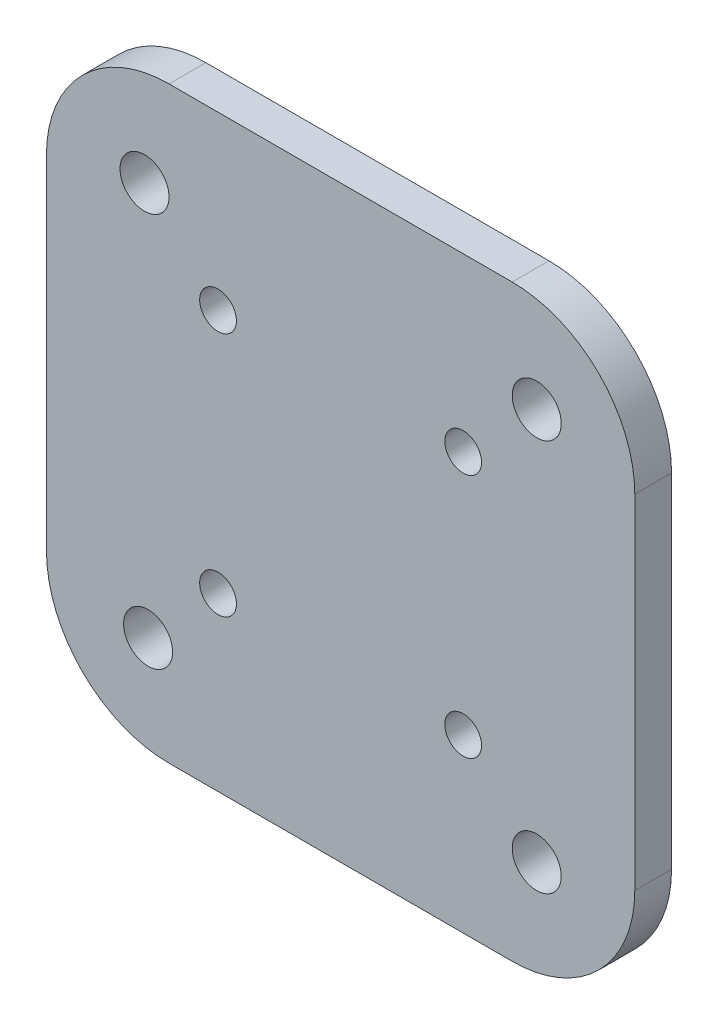
ISO-10303-21;
HEADER;
FILE_DESCRIPTION(('STEP AP214'),'2;1');
FILE_NAME('part.step','',(''),(''),'','','');
FILE_SCHEMA(('AUTOMOTIVE_DESIGN { 1 0 10303 214 1 1 1 1 }'));
ENDSEC;
DATA;
#1=APPLICATION_CONTEXT('core data for automotive mechanical design processes');
#2=APPLICATION_PROTOCOL_DEFINITION('international standard','automotive_design',2000,#1);
#3=PRODUCT_CONTEXT('',#1,'mechanical');
#4=PRODUCT('Part','Part','',(#3));
#5=PRODUCT_RELATED_PRODUCT_CATEGORY('part','',(#4));
#6=PRODUCT_DEFINITION_FORMATION('','',#4);
#7=PRODUCT_DEFINITION_CONTEXT('part definition',#1,'design');
#8=PRODUCT_DEFINITION('design','',#6,#7);
#9=PRODUCT_DEFINITION_SHAPE('','',#8);
#10=(LENGTH_UNIT() NAMED_UNIT(*) SI_UNIT(.MILLI.,.METRE.));
#11=(NAMED_UNIT(*) PLANE_ANGLE_UNIT() SI_UNIT($,.RADIAN.));
#12=(NAMED_UNIT(*) SI_UNIT($,.STERADIAN.) SOLID_ANGLE_UNIT());
#13=UNCERTAINTY_MEASURE_WITH_UNIT(LENGTH_MEASURE(1.E-05),#10,'distance_accuracy_value','');
#14=(GEOMETRIC_REPRESENTATION_CONTEXT(3) GLOBAL_UNCERTAINTY_ASSIGNED_CONTEXT((#13)) GLOBAL_UNIT_ASSIGNED_CONTEXT((#10,
#11,#12)) REPRESENTATION_CONTEXT('',''));
#15=CARTESIAN_POINT('',(0.,0.,0.));
#16=DIRECTION('',(0.,0.,1.));
#17=DIRECTION('',(1.,0.,0.));
#18=AXIS2_PLACEMENT_3D('',#15,#16,#17);
#19=CARTESIAN_POINT('',(-14.,-14.,3.));
#20=DIRECTION('',(0.,0.,1.));
#21=DIRECTION('',(1.,0.,0.));
#22=AXIS2_PLACEMENT_3D('',#19,#20,#21);
#23=CYLINDRICAL_SURFACE('',#22,10.);
#24=DIRECTION('',(0.,0.,1.));
#25=VECTOR('',#24,1.);
#26=CARTESIAN_POINT('',(-24.,-14.,3.));
#27=LINE('',#26,#25);
#28=CARTESIAN_POINT('',(-24.,-14.,0.));
#29=VERTEX_POINT('',#28);
#30=CARTESIAN_POINT('',(-24.,-14.,3.));
#31=VERTEX_POINT('',#30);
#32=EDGE_CURVE('E171',#29,#31,#27,.T.);
#33=ORIENTED_EDGE('',*,*,#32,.F.);
#34=CARTESIAN_POINT('',(-14.,-14.,0.));
#35=DIRECTION('',(0.,0.,1.));
#36=DIRECTION('',(1.,0.,0.));
#37=AXIS2_PLACEMENT_3D('',#34,#35,#36);
#38=CIRCLE('',#37,10.);
#39=CARTESIAN_POINT('',(-14.,-24.,0.));
#40=VERTEX_POINT('',#39);
#41=EDGE_CURVE('E47',#40,#29,#38,.F.);
#42=ORIENTED_EDGE('',*,*,#41,.F.);
#43=DIRECTION('',(0.,0.,1.));
#44=VECTOR('',#43,1.);
#45=CARTESIAN_POINT('',(-14.,-24.,3.));
#46=LINE('',#45,#44);
#47=CARTESIAN_POINT('',(-14.,-24.,3.));
#48=VERTEX_POINT('',#47);
#49=EDGE_CURVE('E175',#48,#40,#46,.F.);
#50=ORIENTED_EDGE('',*,*,#49,.F.);
#51=CARTESIAN_POINT('',(-14.,-14.,3.));
#52=DIRECTION('',(0.,0.,1.));
#53=DIRECTION('',(1.,0.,0.));
#54=AXIS2_PLACEMENT_3D('',#51,#52,#53);
#55=CIRCLE('',#54,10.);
#56=EDGE_CURVE('E11',#31,#48,#55,.T.);
#57=ORIENTED_EDGE('',*,*,#56,.F.);
#58=EDGE_LOOP('',(#33,#42,#50,#57));
#59=FACE_BOUND('',#58,.T.);
#60=ADVANCED_FACE('F39',(#59),#23,.T.);
#61=CARTESIAN_POINT('',(14.,-14.,3.));
#62=DIRECTION('',(0.,0.,-1.));
#63=DIRECTION('',(-1.,0.,0.));
#64=AXIS2_PLACEMENT_3D('',#61,#62,#63);
#65=CYLINDRICAL_SURFACE('',#64,10.);
#66=DIRECTION('',(0.,0.,-1.));
#67=VECTOR('',#66,1.);
#68=CARTESIAN_POINT('',(24.,-14.,3.));
#69=LINE('',#68,#67);
#70=CARTESIAN_POINT('',(24.,-14.,3.));
#71=VERTEX_POINT('',#70);
#72=CARTESIAN_POINT('',(24.,-14.,0.));
#73=VERTEX_POINT('',#72);
#74=EDGE_CURVE('E156',#71,#73,#69,.T.);
#75=ORIENTED_EDGE('',*,*,#74,.F.);
#76=CARTESIAN_POINT('',(14.,-14.,3.));
#77=DIRECTION('',(0.,0.,1.));
#78=DIRECTION('',(1.,0.,0.));
#79=AXIS2_PLACEMENT_3D('',#76,#77,#78);
#80=CIRCLE('',#79,10.);
#81=CARTESIAN_POINT('',(14.,-24.,3.));
#82=VERTEX_POINT('',#81);
#83=EDGE_CURVE('E164',#82,#71,#80,.T.);
#84=ORIENTED_EDGE('',*,*,#83,.F.);
#85=DIRECTION('',(0.,0.,-1.));
#86=VECTOR('',#85,1.);
#87=CARTESIAN_POINT('',(14.,-24.,3.));
#88=LINE('',#87,#86);
#89=CARTESIAN_POINT('',(14.,-24.,0.));
#90=VERTEX_POINT('',#89);
#91=EDGE_CURVE('E160',#90,#82,#88,.F.);
#92=ORIENTED_EDGE('',*,*,#91,.F.);
#93=CARTESIAN_POINT('',(14.,-14.,0.));
#94=DIRECTION('',(0.,0.,1.));
#95=DIRECTION('',(1.,0.,0.));
#96=AXIS2_PLACEMENT_3D('',#93,#94,#95);
#97=CIRCLE('',#96,10.);
#98=EDGE_CURVE('E167',#73,#90,#97,.F.);
#99=ORIENTED_EDGE('',*,*,#98,.F.);
#100=EDGE_LOOP('',(#75,#84,#92,#99));
#101=FACE_BOUND('',#100,.T.);
#102=ADVANCED_FACE('F288',(#101),#65,.T.);
#103=CARTESIAN_POINT('',(14.,14.,3.));
#104=DIRECTION('',(0.,0.,-1.));
#105=DIRECTION('',(-1.,0.,0.));
#106=AXIS2_PLACEMENT_3D('',#103,#104,#105);
#107=CYLINDRICAL_SURFACE('',#106,10.);
#108=DIRECTION('',(0.,0.,-1.));
#109=VECTOR('',#108,1.);
#110=CARTESIAN_POINT('',(14.,24.,3.));
#111=LINE('',#110,#109);
#112=CARTESIAN_POINT('',(14.,24.,3.));
#113=VERTEX_POINT('',#112);
#114=CARTESIAN_POINT('',(14.,24.,0.));
#115=VERTEX_POINT('',#114);
#116=EDGE_CURVE('E109',#113,#115,#111,.T.);
#117=ORIENTED_EDGE('',*,*,#116,.F.);
#118=CARTESIAN_POINT('',(14.,14.,3.));
#119=DIRECTION('',(0.,0.,1.));
#120=DIRECTION('',(1.,0.,0.));
#121=AXIS2_PLACEMENT_3D('',#118,#119,#120);
#122=CIRCLE('',#121,10.);
#123=CARTESIAN_POINT('',(24.,14.,3.));
#124=VERTEX_POINT('',#123);
#125=EDGE_CURVE('E150',#124,#113,#122,.T.);
#126=ORIENTED_EDGE('',*,*,#125,.F.);
#127=DIRECTION('',(0.,0.,-1.));
#128=VECTOR('',#127,1.);
#129=CARTESIAN_POINT('',(24.,14.,3.));
#130=LINE('',#129,#128);
#131=CARTESIAN_POINT('',(24.,14.,0.));
#132=VERTEX_POINT('',#131);
#133=EDGE_CURVE('E146',#132,#124,#130,.F.);
#134=ORIENTED_EDGE('',*,*,#133,.F.);
#135=CARTESIAN_POINT('',(14.,14.,0.));
#136=DIRECTION('',(0.,0.,1.));
#137=DIRECTION('',(1.,0.,0.));
#138=AXIS2_PLACEMENT_3D('',#135,#136,#137);
#139=CIRCLE('',#138,10.);
#140=EDGE_CURVE('E153',#115,#132,#139,.F.);
#141=ORIENTED_EDGE('',*,*,#140,.F.);
#142=EDGE_LOOP('',(#117,#126,#134,#141));
#143=FACE_BOUND('',#142,.T.);
#144=ADVANCED_FACE('F201',(#143),#107,.T.);
#145=CARTESIAN_POINT('',(-14.,14.,3.));
#146=DIRECTION('',(0.,0.,1.));
#147=DIRECTION('',(1.,0.,0.));
#148=AXIS2_PLACEMENT_3D('',#145,#146,#147);
#149=CYLINDRICAL_SURFACE('',#148,10.);
#150=DIRECTION('',(0.,0.,1.));
#151=VECTOR('',#150,1.);
#152=CARTESIAN_POINT('',(-14.,24.,3.));
#153=LINE('',#152,#151);
#154=CARTESIAN_POINT('',(-14.,24.,0.));
#155=VERTEX_POINT('',#154);
#156=CARTESIAN_POINT('',(-14.,24.,3.));
#157=VERTEX_POINT('',#156);
#158=EDGE_CURVE('E107',#155,#157,#153,.T.);
#159=ORIENTED_EDGE('',*,*,#158,.F.);
#160=CARTESIAN_POINT('',(-14.,14.,0.));
#161=DIRECTION('',(0.,0.,1.));
#162=DIRECTION('',(1.,0.,0.));
#163=AXIS2_PLACEMENT_3D('',#160,#161,#162);
#164=CIRCLE('',#163,10.);
#165=CARTESIAN_POINT('',(-24.,14.,0.));
#166=VERTEX_POINT('',#165);
#167=EDGE_CURVE('E117',#166,#155,#164,.F.);
#168=ORIENTED_EDGE('',*,*,#167,.F.);
#169=DIRECTION('',(0.,0.,1.));
#170=VECTOR('',#169,1.);
#171=CARTESIAN_POINT('',(-24.,14.,3.));
#172=LINE('',#171,#170);
#173=CARTESIAN_POINT('',(-24.,14.,3.));
#174=VERTEX_POINT('',#173);
#175=EDGE_CURVE('E128',#174,#166,#172,.F.);
#176=ORIENTED_EDGE('',*,*,#175,.F.);
#177=CARTESIAN_POINT('',(-14.,14.,3.));
#178=DIRECTION('',(0.,0.,1.));
#179=DIRECTION('',(1.,0.,0.));
#180=AXIS2_PLACEMENT_3D('',#177,#178,#179);
#181=CIRCLE('',#180,10.);
#182=EDGE_CURVE('E127',#157,#174,#181,.T.);
#183=ORIENTED_EDGE('',*,*,#182,.F.);
#184=EDGE_LOOP('',(#159,#168,#176,#183));
#185=FACE_BOUND('',#184,.T.);
#186=ADVANCED_FACE('F131',(#185),#149,.T.);
#187=CARTESIAN_POINT('',(0.,0.,3.));
#188=DIRECTION('',(0.,0.,1.));
#189=DIRECTION('',(1.,0.,0.));
#190=AXIS2_PLACEMENT_3D('',#187,#188,#189);
#191=PLANE('',#190);
#192=CARTESIAN_POINT('',(16.,-16.,3.));
#193=DIRECTION('',(0.,0.,1.));
#194=DIRECTION('',(1.,0.,0.));
#195=AXIS2_PLACEMENT_3D('',#192,#193,#194);
#196=CIRCLE('',#195,2.);
#197=CARTESIAN_POINT('',(18.,-16.,3.));
#198=VERTEX_POINT('',#197);
#199=EDGE_CURVE('E252',#198,#198,#196,.T.);
#200=ORIENTED_EDGE('',*,*,#199,.F.);
#201=EDGE_LOOP('',(#200));
#202=FACE_BOUND('',#201,.T.);
#203=CARTESIAN_POINT('',(-16.,16.,3.));
#204=DIRECTION('',(0.,0.,1.));
#205=DIRECTION('',(1.,0.,0.));
#206=AXIS2_PLACEMENT_3D('',#203,#204,#205);
#207=CIRCLE('',#206,2.);
#208=CARTESIAN_POINT('',(-14.,16.,3.));
#209=VERTEX_POINT('',#208);
#210=EDGE_CURVE('E236',#209,#209,#207,.T.);
#211=ORIENTED_EDGE('',*,*,#210,.F.);
#212=EDGE_LOOP('',(#211));
#213=FACE_BOUND('',#212,.T.);
#214=CARTESIAN_POINT('',(-10.,-10.,3.));
#215=DIRECTION('',(0.,0.,1.));
#216=DIRECTION('',(1.,0.,0.));
#217=AXIS2_PLACEMENT_3D('',#214,#215,#216);
#218=CIRCLE('',#217,1.5);
#219=CARTESIAN_POINT('',(-8.5,-10.,3.));
#220=VERTEX_POINT('',#219);
#221=EDGE_CURVE('E220',#220,#220,#218,.T.);
#222=ORIENTED_EDGE('',*,*,#221,.F.);
#223=EDGE_LOOP('',(#222));
#224=FACE_BOUND('',#223,.T.);
#225=CARTESIAN_POINT('',(10.,10.,3.));
#226=DIRECTION('',(0.,0.,1.));
#227=DIRECTION('',(1.,0.,0.));
#228=AXIS2_PLACEMENT_3D('',#225,#226,#227);
#229=CIRCLE('',#228,1.5);
#230=CARTESIAN_POINT('',(11.5,10.,3.));
#231=VERTEX_POINT('',#230);
#232=EDGE_CURVE('E183',#231,#231,#229,.T.);
#233=ORIENTED_EDGE('',*,*,#232,.F.);
#234=EDGE_LOOP('',(#233));
#235=FACE_BOUND('',#234,.T.);
#236=DIRECTION('',(0.,-1.,0.));
#237=VECTOR('',#236,1.);
#238=CARTESIAN_POINT('',(-24.,-24.,3.));
#239=LINE('',#238,#237);
#240=EDGE_CURVE('E113',#174,#31,#239,.T.);
#241=ORIENTED_EDGE('',*,*,#240,.T.);
#242=ORIENTED_EDGE('',*,*,#56,.T.);
#243=DIRECTION('',(1.,0.,0.));
#244=VECTOR('',#243,1.);
#245=CARTESIAN_POINT('',(24.,-24.,3.));
#246=LINE('',#245,#244);
#247=EDGE_CURVE('E206',#48,#82,#246,.T.);
#248=ORIENTED_EDGE('',*,*,#247,.T.);
#249=ORIENTED_EDGE('',*,*,#83,.T.);
#250=DIRECTION('',(0.,1.,0.));
#251=VECTOR('',#250,1.);
#252=CARTESIAN_POINT('',(24.,-24.,3.));
#253=LINE('',#252,#251);
#254=EDGE_CURVE('E138',#71,#124,#253,.T.);
#255=ORIENTED_EDGE('',*,*,#254,.T.);
#256=ORIENTED_EDGE('',*,*,#125,.T.);
#257=DIRECTION('',(-1.,0.,0.));
#258=VECTOR('',#257,1.);
#259=CARTESIAN_POINT('',(24.,24.,3.));
#260=LINE('',#259,#258);
#261=EDGE_CURVE('E133',#113,#157,#260,.T.);
#262=ORIENTED_EDGE('',*,*,#261,.T.);
#263=ORIENTED_EDGE('',*,*,#182,.T.);
#264=EDGE_LOOP('',(#241,#242,#248,#249,#255,#256,#262,#263));
#265=FACE_BOUND('',#264,.T.);
#266=CARTESIAN_POINT('',(-10.,10.,3.));
#267=DIRECTION('',(0.,0.,1.));
#268=DIRECTION('',(1.,0.,0.));
#269=AXIS2_PLACEMENT_3D('',#266,#267,#268);
#270=CIRCLE('',#269,1.5);
#271=CARTESIAN_POINT('',(-8.5,10.,3.));
#272=VERTEX_POINT('',#271);
#273=EDGE_CURVE('E214',#272,#272,#270,.T.);
#274=ORIENTED_EDGE('',*,*,#273,.F.);
#275=EDGE_LOOP('',(#274));
#276=FACE_BOUND('',#275,.T.);
#277=CARTESIAN_POINT('',(10.,-9.99999999999999,3.));
#278=DIRECTION('',(0.,0.,1.));
#279=DIRECTION('',(1.,0.,0.));
#280=AXIS2_PLACEMENT_3D('',#277,#278,#279);
#281=CIRCLE('',#280,1.5);
#282=CARTESIAN_POINT('',(11.5,-9.99999999999999,3.));
#283=VERTEX_POINT('',#282);
#284=EDGE_CURVE('E228',#283,#283,#281,.T.);
#285=ORIENTED_EDGE('',*,*,#284,.F.);
#286=EDGE_LOOP('',(#285));
#287=FACE_BOUND('',#286,.T.);
#288=CARTESIAN_POINT('',(16.,16.,3.));
#289=DIRECTION('',(0.,0.,1.));
#290=DIRECTION('',(1.,0.,0.));
#291=AXIS2_PLACEMENT_3D('',#288,#289,#290);
#292=CIRCLE('',#291,2.);
#293=CARTESIAN_POINT('',(18.,16.,3.));
#294=VERTEX_POINT('',#293);
#295=EDGE_CURVE('E244',#294,#294,#292,.T.);
#296=ORIENTED_EDGE('',*,*,#295,.F.);
#297=EDGE_LOOP('',(#296));
#298=FACE_BOUND('',#297,.T.);
#299=CARTESIAN_POINT('',(-15.7084226772213,-16.,3.));
#300=DIRECTION('',(0.,0.,1.));
#301=DIRECTION('',(1.,0.,0.));
#302=AXIS2_PLACEMENT_3D('',#299,#300,#301);
#303=CIRCLE('',#302,2.);
#304=CARTESIAN_POINT('',(-13.7084226772213,-16.,3.));
#305=VERTEX_POINT('',#304);
#306=EDGE_CURVE('E260',#305,#305,#303,.T.);
#307=ORIENTED_EDGE('',*,*,#306,.F.);
#308=EDGE_LOOP('',(#307));
#309=FACE_BOUND('',#308,.T.);
#310=ADVANCED_FACE('F202',(#202,#213,#224,#235,#265,#276,#287,#298,#309),#191,.T.);
#311=CARTESIAN_POINT('',(0.,0.,0.));
#312=DIRECTION('',(0.,0.,1.));
#313=DIRECTION('',(1.,0.,0.));
#314=AXIS2_PLACEMENT_3D('',#311,#312,#313);
#315=PLANE('',#314);
#316=DIRECTION('',(1.,0.,0.));
#317=VECTOR('',#316,1.);
#318=CARTESIAN_POINT('',(24.,-24.,0.));
#319=LINE('',#318,#317);
#320=EDGE_CURVE('E178',#40,#90,#319,.T.);
#321=ORIENTED_EDGE('',*,*,#320,.F.);
#322=ORIENTED_EDGE('',*,*,#41,.T.);
#323=DIRECTION('',(0.,-1.,0.));
#324=VECTOR('',#323,1.);
#325=CARTESIAN_POINT('',(-24.,-24.,0.));
#326=LINE('',#325,#324);
#327=EDGE_CURVE('E122',#166,#29,#326,.T.);
#328=ORIENTED_EDGE('',*,*,#327,.F.);
#329=ORIENTED_EDGE('',*,*,#167,.T.);
#330=DIRECTION('',(-1.,0.,0.));
#331=VECTOR('',#330,1.);
#332=CARTESIAN_POINT('',(24.,24.,0.));
#333=LINE('',#332,#331);
#334=EDGE_CURVE('E102',#115,#155,#333,.T.);
#335=ORIENTED_EDGE('',*,*,#334,.F.);
#336=ORIENTED_EDGE('',*,*,#140,.T.);
#337=DIRECTION('',(0.,1.,0.));
#338=VECTOR('',#337,1.);
#339=CARTESIAN_POINT('',(24.,-24.,0.));
#340=LINE('',#339,#338);
#341=EDGE_CURVE('E114',#73,#132,#340,.T.);
#342=ORIENTED_EDGE('',*,*,#341,.F.);
#343=ORIENTED_EDGE('',*,*,#98,.T.);
#344=EDGE_LOOP('',(#321,#322,#328,#329,#335,#336,#342,#343));
#345=FACE_BOUND('',#344,.T.);
#346=CARTESIAN_POINT('',(10.,10.,0.));
#347=DIRECTION('',(0.,0.,1.));
#348=DIRECTION('',(1.,0.,0.));
#349=AXIS2_PLACEMENT_3D('',#346,#347,#348);
#350=CIRCLE('',#349,1.5);
#351=CARTESIAN_POINT('',(11.5,10.,0.));
#352=VERTEX_POINT('',#351);
#353=EDGE_CURVE('E189',#352,#352,#350,.T.);
#354=ORIENTED_EDGE('',*,*,#353,.T.);
#355=EDGE_LOOP('',(#354));
#356=FACE_BOUND('',#355,.T.);
#357=CARTESIAN_POINT('',(-10.,10.,0.));
#358=DIRECTION('',(0.,0.,1.));
#359=DIRECTION('',(1.,0.,0.));
#360=AXIS2_PLACEMENT_3D('',#357,#358,#359);
#361=CIRCLE('',#360,1.5);
#362=CARTESIAN_POINT('',(-8.5,10.,0.));
#363=VERTEX_POINT('',#362);
#364=EDGE_CURVE('E216',#363,#363,#361,.T.);
#365=ORIENTED_EDGE('',*,*,#364,.T.);
#366=EDGE_LOOP('',(#365));
#367=FACE_BOUND('',#366,.T.);
#368=CARTESIAN_POINT('',(-10.,-10.,0.));
#369=DIRECTION('',(0.,0.,1.));
#370=DIRECTION('',(1.,0.,0.));
#371=AXIS2_PLACEMENT_3D('',#368,#369,#370);
#372=CIRCLE('',#371,1.5);
#373=CARTESIAN_POINT('',(-8.5,-10.,0.));
#374=VERTEX_POINT('',#373);
#375=EDGE_CURVE('E224',#374,#374,#372,.T.);
#376=ORIENTED_EDGE('',*,*,#375,.T.);
#377=EDGE_LOOP('',(#376));
#378=FACE_BOUND('',#377,.T.);
#379=CARTESIAN_POINT('',(10.,-9.99999999999999,0.));
#380=DIRECTION('',(0.,0.,1.));
#381=DIRECTION('',(1.,0.,0.));
#382=AXIS2_PLACEMENT_3D('',#379,#380,#381);
#383=CIRCLE('',#382,1.5);
#384=CARTESIAN_POINT('',(11.5,-9.99999999999999,0.));
#385=VERTEX_POINT('',#384);
#386=EDGE_CURVE('E232',#385,#385,#383,.T.);
#387=ORIENTED_EDGE('',*,*,#386,.T.);
#388=EDGE_LOOP('',(#387));
#389=FACE_BOUND('',#388,.T.);
#390=CARTESIAN_POINT('',(-16.,16.,0.));
#391=DIRECTION('',(0.,0.,1.));
#392=DIRECTION('',(1.,0.,0.));
#393=AXIS2_PLACEMENT_3D('',#390,#391,#392);
#394=CIRCLE('',#393,2.);
#395=CARTESIAN_POINT('',(-14.,16.,0.));
#396=VERTEX_POINT('',#395);
#397=EDGE_CURVE('E240',#396,#396,#394,.T.);
#398=ORIENTED_EDGE('',*,*,#397,.T.);
#399=EDGE_LOOP('',(#398));
#400=FACE_BOUND('',#399,.T.);
#401=CARTESIAN_POINT('',(16.,16.,0.));
#402=DIRECTION('',(0.,0.,1.));
#403=DIRECTION('',(1.,0.,0.));
#404=AXIS2_PLACEMENT_3D('',#401,#402,#403);
#405=CIRCLE('',#404,2.);
#406=CARTESIAN_POINT('',(18.,16.,0.));
#407=VERTEX_POINT('',#406);
#408=EDGE_CURVE('E248',#407,#407,#405,.T.);
#409=ORIENTED_EDGE('',*,*,#408,.T.);
#410=EDGE_LOOP('',(#409));
#411=FACE_BOUND('',#410,.T.);
#412=CARTESIAN_POINT('',(16.,-16.,0.));
#413=DIRECTION('',(0.,0.,1.));
#414=DIRECTION('',(1.,0.,0.));
#415=AXIS2_PLACEMENT_3D('',#412,#413,#414);
#416=CIRCLE('',#415,2.);
#417=CARTESIAN_POINT('',(18.,-16.,0.));
#418=VERTEX_POINT('',#417);
#419=EDGE_CURVE('E256',#418,#418,#416,.T.);
#420=ORIENTED_EDGE('',*,*,#419,.T.);
#421=EDGE_LOOP('',(#420));
#422=FACE_BOUND('',#421,.T.);
#423=CARTESIAN_POINT('',(-15.7084226772213,-16.,0.));
#424=DIRECTION('',(0.,0.,1.));
#425=DIRECTION('',(1.,0.,0.));
#426=AXIS2_PLACEMENT_3D('',#423,#424,#425);
#427=CIRCLE('',#426,2.);
#428=CARTESIAN_POINT('',(-13.7084226772213,-16.,0.));
#429=VERTEX_POINT('',#428);
#430=EDGE_CURVE('E264',#429,#429,#427,.T.);
#431=ORIENTED_EDGE('',*,*,#430,.T.);
#432=EDGE_LOOP('',(#431));
#433=FACE_BOUND('',#432,.T.);
#434=ADVANCED_FACE('F119',(#345,#356,#367,#378,#389,#400,#411,#422,#433),#315,.F.);
#435=CARTESIAN_POINT('',(-24.,-24.,3.));
#436=DIRECTION('',(1.,0.,0.));
#437=DIRECTION('',(0.,0.,-1.));
#438=AXIS2_PLACEMENT_3D('',#435,#436,#437);
#439=PLANE('',#438);
#440=ORIENTED_EDGE('',*,*,#327,.T.);
#441=ORIENTED_EDGE('',*,*,#32,.T.);
#442=ORIENTED_EDGE('',*,*,#240,.F.);
#443=ORIENTED_EDGE('',*,*,#175,.T.);
#444=EDGE_LOOP('',(#440,#441,#442,#443));
#445=FACE_BOUND('',#444,.T.);
#446=ADVANCED_FACE('F181',(#445),#439,.F.);
#447=CARTESIAN_POINT('',(24.,-24.,3.));
#448=DIRECTION('',(0.,1.,0.));
#449=DIRECTION('',(-1.,0.,0.));
#450=AXIS2_PLACEMENT_3D('',#447,#448,#449);
#451=PLANE('',#450);
#452=ORIENTED_EDGE('',*,*,#247,.F.);
#453=ORIENTED_EDGE('',*,*,#49,.T.);
#454=ORIENTED_EDGE('',*,*,#320,.T.);
#455=ORIENTED_EDGE('',*,*,#91,.T.);
#456=EDGE_LOOP('',(#452,#453,#454,#455));
#457=FACE_BOUND('',#456,.T.);
#458=ADVANCED_FACE('F300',(#457),#451,.F.);
#459=CARTESIAN_POINT('',(24.,-24.,3.));
#460=DIRECTION('',(-1.,0.,0.));
#461=DIRECTION('',(0.,0.,1.));
#462=AXIS2_PLACEMENT_3D('',#459,#460,#461);
#463=PLANE('',#462);
#464=ORIENTED_EDGE('',*,*,#254,.F.);
#465=ORIENTED_EDGE('',*,*,#74,.T.);
#466=ORIENTED_EDGE('',*,*,#341,.T.);
#467=ORIENTED_EDGE('',*,*,#133,.T.);
#468=EDGE_LOOP('',(#464,#465,#466,#467));
#469=FACE_BOUND('',#468,.T.);
#470=ADVANCED_FACE('F196',(#469),#463,.F.);
#471=CARTESIAN_POINT('',(24.,24.,3.));
#472=DIRECTION('',(0.,-1.,0.));
#473=DIRECTION('',(1.,0.,0.));
#474=AXIS2_PLACEMENT_3D('',#471,#472,#473);
#475=PLANE('',#474);
#476=ORIENTED_EDGE('',*,*,#261,.F.);
#477=ORIENTED_EDGE('',*,*,#116,.T.);
#478=ORIENTED_EDGE('',*,*,#334,.T.);
#479=ORIENTED_EDGE('',*,*,#158,.T.);
#480=EDGE_LOOP('',(#476,#477,#478,#479));
#481=FACE_BOUND('',#480,.T.);
#482=ADVANCED_FACE('F105',(#481),#475,.F.);
#483=CARTESIAN_POINT('',(10.,10.,3.));
#484=DIRECTION('',(0.,0.,-1.));
#485=DIRECTION('',(-1.,0.,0.));
#486=AXIS2_PLACEMENT_3D('',#483,#484,#485);
#487=CYLINDRICAL_SURFACE('',#486,1.5);
#488=ORIENTED_EDGE('',*,*,#232,.T.);
#489=EDGE_LOOP('',(#488));
#490=FACE_BOUND('',#489,.T.);
#491=ORIENTED_EDGE('',*,*,#353,.F.);
#492=EDGE_LOOP('',(#491));
#493=FACE_BOUND('',#492,.T.);
#494=ADVANCED_FACE('F307',(#490,#493),#487,.F.);
#495=CARTESIAN_POINT('',(-10.,10.,3.));
#496=DIRECTION('',(0.,0.,-1.));
#497=DIRECTION('',(-1.,0.,0.));
#498=AXIS2_PLACEMENT_3D('',#495,#496,#497);
#499=CYLINDRICAL_SURFACE('',#498,1.5);
#500=ORIENTED_EDGE('',*,*,#273,.T.);
#501=EDGE_LOOP('',(#500));
#502=FACE_BOUND('',#501,.T.);
#503=ORIENTED_EDGE('',*,*,#364,.F.);
#504=EDGE_LOOP('',(#503));
#505=FACE_BOUND('',#504,.T.);
#506=ADVANCED_FACE('F311',(#502,#505),#499,.F.);
#507=CARTESIAN_POINT('',(-10.,-10.,3.));
#508=DIRECTION('',(0.,0.,-1.));
#509=DIRECTION('',(-1.,0.,0.));
#510=AXIS2_PLACEMENT_3D('',#507,#508,#509);
#511=CYLINDRICAL_SURFACE('',#510,1.5);
#512=ORIENTED_EDGE('',*,*,#221,.T.);
#513=EDGE_LOOP('',(#512));
#514=FACE_BOUND('',#513,.T.);
#515=ORIENTED_EDGE('',*,*,#375,.F.);
#516=EDGE_LOOP('',(#515));
#517=FACE_BOUND('',#516,.T.);
#518=ADVANCED_FACE('F316',(#514,#517),#511,.F.);
#519=CARTESIAN_POINT('',(10.,-9.99999999999999,3.));
#520=DIRECTION('',(0.,0.,-1.));
#521=DIRECTION('',(-1.,0.,0.));
#522=AXIS2_PLACEMENT_3D('',#519,#520,#521);
#523=CYLINDRICAL_SURFACE('',#522,1.5);
#524=ORIENTED_EDGE('',*,*,#284,.T.);
#525=EDGE_LOOP('',(#524));
#526=FACE_BOUND('',#525,.T.);
#527=ORIENTED_EDGE('',*,*,#386,.F.);
#528=EDGE_LOOP('',(#527));
#529=FACE_BOUND('',#528,.T.);
#530=ADVANCED_FACE('F323',(#526,#529),#523,.F.);
#531=CARTESIAN_POINT('',(-16.,16.,3.));
#532=DIRECTION('',(0.,0.,-1.));
#533=DIRECTION('',(-1.,0.,0.));
#534=AXIS2_PLACEMENT_3D('',#531,#532,#533);
#535=CYLINDRICAL_SURFACE('',#534,2.);
#536=ORIENTED_EDGE('',*,*,#210,.T.);
#537=EDGE_LOOP('',(#536));
#538=FACE_BOUND('',#537,.T.);
#539=ORIENTED_EDGE('',*,*,#397,.F.);
#540=EDGE_LOOP('',(#539));
#541=FACE_BOUND('',#540,.T.);
#542=ADVANCED_FACE('F327',(#538,#541),#535,.F.);
#543=CARTESIAN_POINT('',(16.,16.,3.));
#544=DIRECTION('',(0.,0.,-1.));
#545=DIRECTION('',(-1.,0.,0.));
#546=AXIS2_PLACEMENT_3D('',#543,#544,#545);
#547=CYLINDRICAL_SURFACE('',#546,2.);
#548=ORIENTED_EDGE('',*,*,#295,.T.);
#549=EDGE_LOOP('',(#548));
#550=FACE_BOUND('',#549,.T.);
#551=ORIENTED_EDGE('',*,*,#408,.F.);
#552=EDGE_LOOP('',(#551));
#553=FACE_BOUND('',#552,.T.);
#554=ADVANCED_FACE('F331',(#550,#553),#547,.F.);
#555=CARTESIAN_POINT('',(16.,-16.,3.));
#556=DIRECTION('',(0.,0.,-1.));
#557=DIRECTION('',(-1.,0.,0.));
#558=AXIS2_PLACEMENT_3D('',#555,#556,#557);
#559=CYLINDRICAL_SURFACE('',#558,2.);
#560=ORIENTED_EDGE('',*,*,#199,.T.);
#561=EDGE_LOOP('',(#560));
#562=FACE_BOUND('',#561,.T.);
#563=ORIENTED_EDGE('',*,*,#419,.F.);
#564=EDGE_LOOP('',(#563));
#565=FACE_BOUND('',#564,.T.);
#566=ADVANCED_FACE('F335',(#562,#565),#559,.F.);
#567=CARTESIAN_POINT('',(-15.7084226772213,-16.,3.));
#568=DIRECTION('',(0.,0.,-1.));
#569=DIRECTION('',(-1.,0.,0.));
#570=AXIS2_PLACEMENT_3D('',#567,#568,#569);
#571=CYLINDRICAL_SURFACE('',#570,2.);
#572=ORIENTED_EDGE('',*,*,#306,.T.);
#573=EDGE_LOOP('',(#572));
#574=FACE_BOUND('',#573,.T.);
#575=ORIENTED_EDGE('',*,*,#430,.F.);
#576=EDGE_LOOP('',(#575));
#577=FACE_BOUND('',#576,.T.);
#578=ADVANCED_FACE('F272',(#574,#577),#571,.F.);
#579=CLOSED_SHELL('',(#60,#102,#144,#186,#310,#434,#446,#458,#470,#482,#494,#506,#518,#530,#542,
#554,#566,#578));
#580=MANIFOLD_SOLID_BREP('B2',#579);
#581=ADVANCED_BREP_SHAPE_REPRESENTATION('',(#18,#580),#14);
#582=SHAPE_DEFINITION_REPRESENTATION(#9,#581);
ENDSEC;
END-ISO-10303-21;
